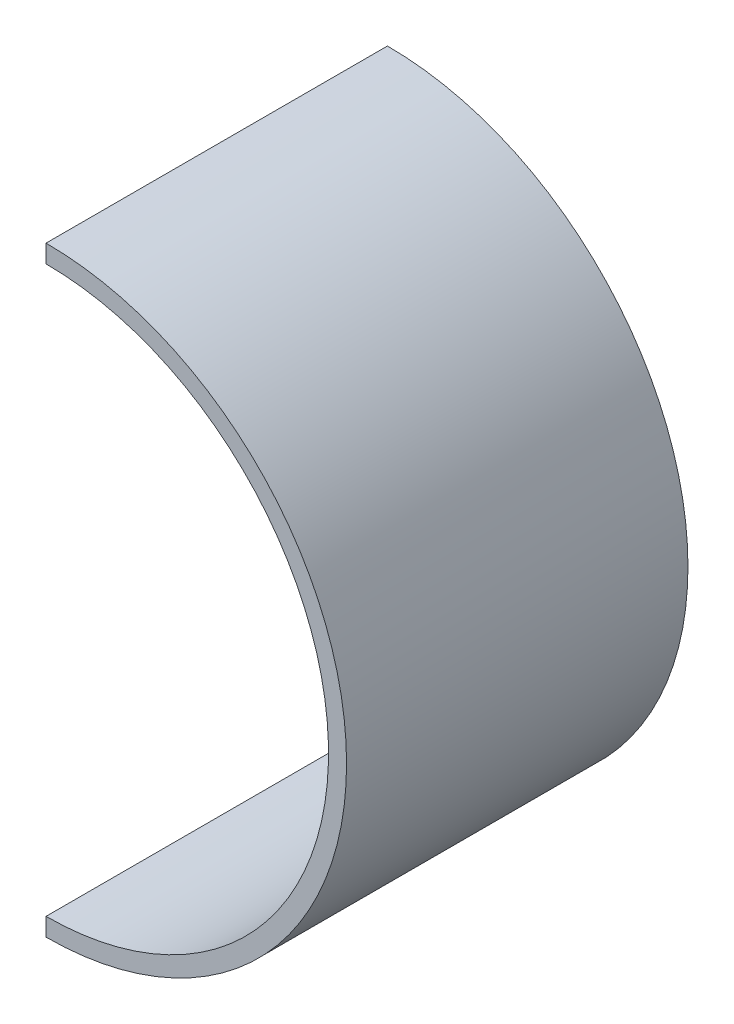
ISO-10303-21;
HEADER;
FILE_DESCRIPTION(('STEP AP214'),'2;1');
FILE_NAME('part.step','',(''),(''),'','','');
FILE_SCHEMA(('AUTOMOTIVE_DESIGN { 1 0 10303 214 1 1 1 1 }'));
ENDSEC;
DATA;
#1=APPLICATION_CONTEXT('core data for automotive mechanical design processes');
#2=APPLICATION_PROTOCOL_DEFINITION('international standard','automotive_design',2000,#1);
#3=PRODUCT_CONTEXT('',#1,'mechanical');
#4=PRODUCT('Part','Part','',(#3));
#5=PRODUCT_RELATED_PRODUCT_CATEGORY('part','',(#4));
#6=PRODUCT_DEFINITION_FORMATION('','',#4);
#7=PRODUCT_DEFINITION_CONTEXT('part definition',#1,'design');
#8=PRODUCT_DEFINITION('design','',#6,#7);
#9=PRODUCT_DEFINITION_SHAPE('','',#8);
#10=(LENGTH_UNIT() NAMED_UNIT(*) SI_UNIT(.MILLI.,.METRE.));
#11=(NAMED_UNIT(*) PLANE_ANGLE_UNIT() SI_UNIT($,.RADIAN.));
#12=(NAMED_UNIT(*) SI_UNIT($,.STERADIAN.) SOLID_ANGLE_UNIT());
#13=UNCERTAINTY_MEASURE_WITH_UNIT(LENGTH_MEASURE(1.E-05),#10,'distance_accuracy_value','');
#14=(GEOMETRIC_REPRESENTATION_CONTEXT(3) GLOBAL_UNCERTAINTY_ASSIGNED_CONTEXT((#13)) GLOBAL_UNIT_ASSIGNED_CONTEXT((#10,
#11,#12)) REPRESENTATION_CONTEXT('',''));
#15=CARTESIAN_POINT('',(0.,0.,0.));
#16=DIRECTION('',(0.,0.,1.));
#17=DIRECTION('',(1.,0.,0.));
#18=AXIS2_PLACEMENT_3D('',#15,#16,#17);
#19=CARTESIAN_POINT('',(300.,1.71683972880179E-13,0.));
#20=DIRECTION('',(-1.,0.,0.));
#21=DIRECTION('',(0.,-1.,0.));
#22=AXIS2_PLACEMENT_3D('',#19,#20,#21);
#23=PLANE('',#22);
#24=DIRECTION('',(0.,0.,1.));
#25=VECTOR('',#24,1.);
#26=CARTESIAN_POINT('',(300.,47.,3.));
#27=LINE('',#26,#25);
#28=CARTESIAN_POINT('',(300.,47.,3.1));
#29=VERTEX_POINT('',#28);
#30=CARTESIAN_POINT('',(300.,47.,59.9));
#31=VERTEX_POINT('',#30);
#32=EDGE_CURVE('E35',#29,#31,#27,.T.);
#33=ORIENTED_EDGE('',*,*,#32,.T.);
#34=DIRECTION('',(0.,-1.,0.));
#35=VECTOR('',#34,1.);
#36=CARTESIAN_POINT('',(300.,1.71683972880179E-13,59.9));
#37=LINE('',#36,#35);
#38=CARTESIAN_POINT('',(300.,50.,59.9));
#39=VERTEX_POINT('',#38);
#40=EDGE_CURVE('E85',#39,#31,#37,.T.);
#41=ORIENTED_EDGE('',*,*,#40,.F.);
#42=DIRECTION('',(0.,0.,-1.));
#43=VECTOR('',#42,1.);
#44=CARTESIAN_POINT('',(300.,50.,60.));
#45=LINE('',#44,#43);
#46=CARTESIAN_POINT('',(300.,50.,3.1));
#47=VERTEX_POINT('',#46);
#48=EDGE_CURVE('E75',#39,#47,#45,.T.);
#49=ORIENTED_EDGE('',*,*,#48,.T.);
#50=DIRECTION('',(0.,-1.,0.));
#51=VECTOR('',#50,1.);
#52=CARTESIAN_POINT('',(300.,1.71683972880179E-13,3.1));
#53=LINE('',#52,#51);
#54=EDGE_CURVE('E80',#47,#29,#53,.T.);
#55=ORIENTED_EDGE('',*,*,#54,.T.);
#56=EDGE_LOOP('',(#33,#41,#49,#55));
#57=FACE_BOUND('',#56,.T.);
#58=ADVANCED_FACE('F32',(#57),#23,.T.);
#59=DIRECTION('',(0.,0.,1.));
#60=VECTOR('',#59,1.);
#61=CARTESIAN_POINT('',(300.,-47.,3.));
#62=LINE('',#61,#60);
#63=CARTESIAN_POINT('',(300.,-47.,3.1));
#64=VERTEX_POINT('',#63);
#65=CARTESIAN_POINT('',(300.,-47.,59.9));
#66=VERTEX_POINT('',#65);
#67=EDGE_CURVE('E54',#64,#66,#62,.T.);
#68=ORIENTED_EDGE('',*,*,#67,.F.);
#69=DIRECTION('',(0.,-1.,0.));
#70=VECTOR('',#69,1.);
#71=CARTESIAN_POINT('',(300.,1.71683972880179E-13,3.1));
#72=LINE('',#71,#70);
#73=CARTESIAN_POINT('',(300.,-50.,3.1));
#74=VERTEX_POINT('',#73);
#75=EDGE_CURVE('E93',#64,#74,#72,.T.);
#76=ORIENTED_EDGE('',*,*,#75,.T.);
#77=DIRECTION('',(0.,0.,-1.));
#78=VECTOR('',#77,1.);
#79=CARTESIAN_POINT('',(300.,-50.,60.));
#80=LINE('',#79,#78);
#81=CARTESIAN_POINT('',(300.,-50.,59.9));
#82=VERTEX_POINT('',#81);
#83=EDGE_CURVE('E100',#82,#74,#80,.T.);
#84=ORIENTED_EDGE('',*,*,#83,.F.);
#85=DIRECTION('',(0.,-1.,0.));
#86=VECTOR('',#85,1.);
#87=CARTESIAN_POINT('',(300.,1.71683972880179E-13,59.9));
#88=LINE('',#87,#86);
#89=EDGE_CURVE('E87',#66,#82,#88,.T.);
#90=ORIENTED_EDGE('',*,*,#89,.F.);
#91=EDGE_LOOP('',(#68,#76,#84,#90));
#92=FACE_BOUND('',#91,.T.);
#93=ADVANCED_FACE('F105',(#92),#23,.T.);
#94=CARTESIAN_POINT('',(300.,0.,3.));
#95=DIRECTION('',(0.,0.,1.));
#96=DIRECTION('',(1.,0.,0.));
#97=AXIS2_PLACEMENT_3D('',#94,#95,#96);
#98=CYLINDRICAL_SURFACE('',#97,47.);
#99=ORIENTED_EDGE('',*,*,#67,.T.);
#100=CARTESIAN_POINT('',(300.,0.,59.9));
#101=DIRECTION('',(0.,0.,-1.));
#102=DIRECTION('',(-1.,0.,0.));
#103=AXIS2_PLACEMENT_3D('',#100,#101,#102);
#104=CIRCLE('',#103,47.);
#105=EDGE_CURVE('E11',#66,#31,#104,.F.);
#106=ORIENTED_EDGE('',*,*,#105,.T.);
#107=ORIENTED_EDGE('',*,*,#32,.F.);
#108=CARTESIAN_POINT('',(300.,0.,3.1));
#109=DIRECTION('',(0.,0.,-1.));
#110=DIRECTION('',(-1.,0.,0.));
#111=AXIS2_PLACEMENT_3D('',#108,#109,#110);
#112=CIRCLE('',#111,47.);
#113=EDGE_CURVE('E96',#64,#29,#112,.F.);
#114=ORIENTED_EDGE('',*,*,#113,.F.);
#115=EDGE_LOOP('',(#99,#106,#107,#114));
#116=FACE_BOUND('',#115,.T.);
#117=ADVANCED_FACE('F107',(#116),#98,.F.);
#118=CARTESIAN_POINT('',(300.,0.,60.));
#119=DIRECTION('',(0.,0.,-1.));
#120=DIRECTION('',(-1.,0.,0.));
#121=AXIS2_PLACEMENT_3D('',#118,#119,#120);
#122=CYLINDRICAL_SURFACE('',#121,50.);
#123=ORIENTED_EDGE('',*,*,#48,.F.);
#124=CARTESIAN_POINT('',(300.,0.,59.9));
#125=DIRECTION('',(0.,0.,-1.));
#126=DIRECTION('',(-1.,0.,0.));
#127=AXIS2_PLACEMENT_3D('',#124,#125,#126);
#128=CIRCLE('',#127,50.);
#129=EDGE_CURVE('E40',#39,#82,#128,.T.);
#130=ORIENTED_EDGE('',*,*,#129,.T.);
#131=ORIENTED_EDGE('',*,*,#83,.T.);
#132=CARTESIAN_POINT('',(300.,0.,3.1));
#133=DIRECTION('',(0.,0.,-1.));
#134=DIRECTION('',(-1.,0.,0.));
#135=AXIS2_PLACEMENT_3D('',#132,#133,#134);
#136=CIRCLE('',#135,50.);
#137=EDGE_CURVE('E79',#47,#74,#136,.T.);
#138=ORIENTED_EDGE('',*,*,#137,.F.);
#139=EDGE_LOOP('',(#123,#130,#131,#138));
#140=FACE_BOUND('',#139,.T.);
#141=ADVANCED_FACE('F77',(#140),#122,.T.);
#142=CARTESIAN_POINT('',(0.,0.,59.9));
#143=DIRECTION('',(0.,0.,-1.));
#144=DIRECTION('',(-1.,0.,0.));
#145=AXIS2_PLACEMENT_3D('',#142,#143,#144);
#146=PLANE('',#145);
#147=ORIENTED_EDGE('',*,*,#89,.T.);
#148=ORIENTED_EDGE('',*,*,#129,.F.);
#149=ORIENTED_EDGE('',*,*,#40,.T.);
#150=ORIENTED_EDGE('',*,*,#105,.F.);
#151=EDGE_LOOP('',(#147,#148,#149,#150));
#152=FACE_BOUND('',#151,.T.);
#153=ADVANCED_FACE('F84',(#152),#146,.F.);
#154=CARTESIAN_POINT('',(0.,0.,3.1));
#155=DIRECTION('',(0.,0.,-1.));
#156=DIRECTION('',(-1.,0.,0.));
#157=AXIS2_PLACEMENT_3D('',#154,#155,#156);
#158=PLANE('',#157);
#159=ORIENTED_EDGE('',*,*,#137,.T.);
#160=ORIENTED_EDGE('',*,*,#75,.F.);
#161=ORIENTED_EDGE('',*,*,#113,.T.);
#162=ORIENTED_EDGE('',*,*,#54,.F.);
#163=EDGE_LOOP('',(#159,#160,#161,#162));
#164=FACE_BOUND('',#163,.T.);
#165=ADVANCED_FACE('F104',(#164),#158,.T.);
#166=CLOSED_SHELL('',(#58,#93,#117,#141,#153,#165));
#167=MANIFOLD_SOLID_BREP('B2',#166);
#168=ADVANCED_BREP_SHAPE_REPRESENTATION('',(#18,#167),#14);
#169=SHAPE_DEFINITION_REPRESENTATION(#9,#168);
ENDSEC;
END-ISO-10303-21;
